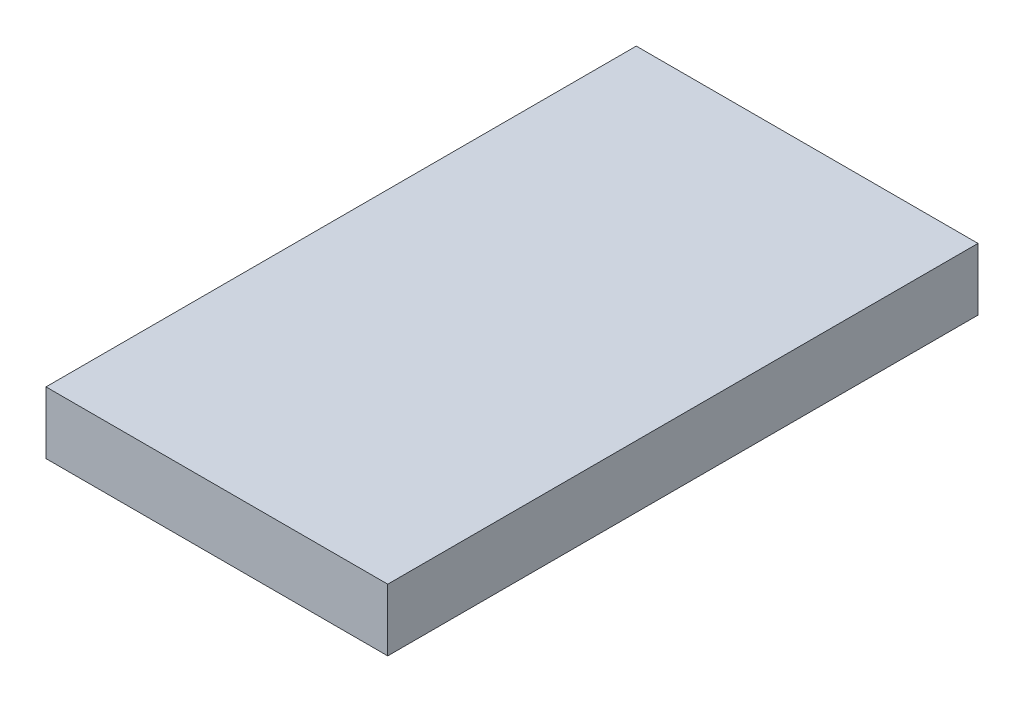
ISO-10303-21;
HEADER;
FILE_DESCRIPTION(('STEP AP214'),'2;1');
FILE_NAME('part.step','',(''),(''),'','','');
FILE_SCHEMA(('AUTOMOTIVE_DESIGN { 1 0 10303 214 1 1 1 1 }'));
ENDSEC;
DATA;
#1=APPLICATION_CONTEXT('core data for automotive mechanical design processes');
#2=APPLICATION_PROTOCOL_DEFINITION('international standard','automotive_design',2000,#1);
#3=PRODUCT_CONTEXT('',#1,'mechanical');
#4=PRODUCT('Part','Part','',(#3));
#5=PRODUCT_RELATED_PRODUCT_CATEGORY('part','',(#4));
#6=PRODUCT_DEFINITION_FORMATION('','',#4);
#7=PRODUCT_DEFINITION_CONTEXT('part definition',#1,'design');
#8=PRODUCT_DEFINITION('design','',#6,#7);
#9=PRODUCT_DEFINITION_SHAPE('','',#8);
#10=(LENGTH_UNIT() NAMED_UNIT(*) SI_UNIT(.MILLI.,.METRE.));
#11=(NAMED_UNIT(*) PLANE_ANGLE_UNIT() SI_UNIT($,.RADIAN.));
#12=(NAMED_UNIT(*) SI_UNIT($,.STERADIAN.) SOLID_ANGLE_UNIT());
#13=UNCERTAINTY_MEASURE_WITH_UNIT(LENGTH_MEASURE(1.E-05),#10,'distance_accuracy_value','');
#14=(GEOMETRIC_REPRESENTATION_CONTEXT(3) GLOBAL_UNCERTAINTY_ASSIGNED_CONTEXT((#13)) GLOBAL_UNIT_ASSIGNED_CONTEXT((#10,
#11,#12)) REPRESENTATION_CONTEXT('',''));
#15=CARTESIAN_POINT('',(0.,0.,0.));
#16=DIRECTION('',(0.,0.,1.));
#17=DIRECTION('',(1.,0.,0.));
#18=AXIS2_PLACEMENT_3D('',#15,#16,#17);
#19=CARTESIAN_POINT('',(13.75,5.,-23.75));
#20=DIRECTION('',(-1.,0.,0.));
#21=DIRECTION('',(0.,0.,1.));
#22=AXIS2_PLACEMENT_3D('',#19,#20,#21);
#23=PLANE('',#22);
#24=DIRECTION('',(0.,0.,-1.));
#25=VECTOR('',#24,1.);
#26=CARTESIAN_POINT('',(13.75,0.,-23.75));
#27=LINE('',#26,#25);
#28=CARTESIAN_POINT('',(13.75,0.,23.75));
#29=VERTEX_POINT('',#28);
#30=CARTESIAN_POINT('',(13.75,0.,-23.75));
#31=VERTEX_POINT('',#30);
#32=EDGE_CURVE('E96',#29,#31,#27,.T.);
#33=ORIENTED_EDGE('',*,*,#32,.T.);
#34=DIRECTION('',(0.,-1.,0.));
#35=VECTOR('',#34,1.);
#36=CARTESIAN_POINT('',(13.75,5.,-23.75));
#37=LINE('',#36,#35);
#38=CARTESIAN_POINT('',(13.75,5.,-23.75));
#39=VERTEX_POINT('',#38);
#40=EDGE_CURVE('E11',#39,#31,#37,.T.);
#41=ORIENTED_EDGE('',*,*,#40,.F.);
#42=DIRECTION('',(0.,0.,-1.));
#43=VECTOR('',#42,1.);
#44=CARTESIAN_POINT('',(13.75,5.,-23.75));
#45=LINE('',#44,#43);
#46=CARTESIAN_POINT('',(13.75,5.,23.75));
#47=VERTEX_POINT('',#46);
#48=EDGE_CURVE('E84',#47,#39,#45,.T.);
#49=ORIENTED_EDGE('',*,*,#48,.F.);
#50=DIRECTION('',(0.,-1.,0.));
#51=VECTOR('',#50,1.);
#52=CARTESIAN_POINT('',(13.75,5.,23.75));
#53=LINE('',#52,#51);
#54=EDGE_CURVE('E92',#47,#29,#53,.T.);
#55=ORIENTED_EDGE('',*,*,#54,.T.);
#56=EDGE_LOOP('',(#33,#41,#49,#55));
#57=FACE_BOUND('',#56,.T.);
#58=ADVANCED_FACE('F33',(#57),#23,.F.);
#59=CARTESIAN_POINT('',(-13.75,5.,-23.75));
#60=DIRECTION('',(0.,0.,1.));
#61=DIRECTION('',(1.,0.,0.));
#62=AXIS2_PLACEMENT_3D('',#59,#60,#61);
#63=PLANE('',#62);
#64=DIRECTION('',(-1.,0.,0.));
#65=VECTOR('',#64,1.);
#66=CARTESIAN_POINT('',(-13.75,0.,-23.75));
#67=LINE('',#66,#65);
#68=CARTESIAN_POINT('',(-13.75,0.,-23.75));
#69=VERTEX_POINT('',#68);
#70=EDGE_CURVE('E88',#31,#69,#67,.T.);
#71=ORIENTED_EDGE('',*,*,#70,.T.);
#72=DIRECTION('',(0.,-1.,0.));
#73=VECTOR('',#72,1.);
#74=CARTESIAN_POINT('',(-13.75,5.,-23.75));
#75=LINE('',#74,#73);
#76=CARTESIAN_POINT('',(-13.75,5.,-23.75));
#77=VERTEX_POINT('',#76);
#78=EDGE_CURVE('E41',#77,#69,#75,.T.);
#79=ORIENTED_EDGE('',*,*,#78,.F.);
#80=DIRECTION('',(-1.,0.,0.));
#81=VECTOR('',#80,1.);
#82=CARTESIAN_POINT('',(-13.75,5.,-23.75));
#83=LINE('',#82,#81);
#84=EDGE_CURVE('E79',#39,#77,#83,.T.);
#85=ORIENTED_EDGE('',*,*,#84,.F.);
#86=ORIENTED_EDGE('',*,*,#40,.T.);
#87=EDGE_LOOP('',(#71,#79,#85,#86));
#88=FACE_BOUND('',#87,.T.);
#89=ADVANCED_FACE('F87',(#88),#63,.F.);
#90=CARTESIAN_POINT('',(-13.75,5.,-23.75));
#91=DIRECTION('',(1.,0.,0.));
#92=DIRECTION('',(0.,0.,-1.));
#93=AXIS2_PLACEMENT_3D('',#90,#91,#92);
#94=PLANE('',#93);
#95=DIRECTION('',(0.,0.,1.));
#96=VECTOR('',#95,1.);
#97=CARTESIAN_POINT('',(-13.75,0.,-23.75));
#98=LINE('',#97,#96);
#99=CARTESIAN_POINT('',(-13.75,0.,23.75));
#100=VERTEX_POINT('',#99);
#101=EDGE_CURVE('E66',#69,#100,#98,.T.);
#102=ORIENTED_EDGE('',*,*,#101,.T.);
#103=DIRECTION('',(0.,-1.,0.));
#104=VECTOR('',#103,1.);
#105=CARTESIAN_POINT('',(-13.75,5.,23.75));
#106=LINE('',#105,#104);
#107=CARTESIAN_POINT('',(-13.75,5.,23.75));
#108=VERTEX_POINT('',#107);
#109=EDGE_CURVE('E89',#108,#100,#106,.T.);
#110=ORIENTED_EDGE('',*,*,#109,.F.);
#111=DIRECTION('',(0.,0.,1.));
#112=VECTOR('',#111,1.);
#113=CARTESIAN_POINT('',(-13.75,5.,-23.75));
#114=LINE('',#113,#112);
#115=EDGE_CURVE('E82',#77,#108,#114,.T.);
#116=ORIENTED_EDGE('',*,*,#115,.F.);
#117=ORIENTED_EDGE('',*,*,#78,.T.);
#118=EDGE_LOOP('',(#102,#110,#116,#117));
#119=FACE_BOUND('',#118,.T.);
#120=ADVANCED_FACE('F90',(#119),#94,.F.);
#121=CARTESIAN_POINT('',(-13.75,5.,23.75));
#122=DIRECTION('',(0.,0.,-1.));
#123=DIRECTION('',(-1.,0.,0.));
#124=AXIS2_PLACEMENT_3D('',#121,#122,#123);
#125=PLANE('',#124);
#126=DIRECTION('',(1.,0.,0.));
#127=VECTOR('',#126,1.);
#128=CARTESIAN_POINT('',(-13.75,0.,23.75));
#129=LINE('',#128,#127);
#130=EDGE_CURVE('E72',#100,#29,#129,.T.);
#131=ORIENTED_EDGE('',*,*,#130,.T.);
#132=ORIENTED_EDGE('',*,*,#54,.F.);
#133=DIRECTION('',(1.,0.,0.));
#134=VECTOR('',#133,1.);
#135=CARTESIAN_POINT('',(-13.75,5.,23.75));
#136=LINE('',#135,#134);
#137=EDGE_CURVE('E49',#108,#47,#136,.T.);
#138=ORIENTED_EDGE('',*,*,#137,.F.);
#139=ORIENTED_EDGE('',*,*,#109,.T.);
#140=EDGE_LOOP('',(#131,#132,#138,#139));
#141=FACE_BOUND('',#140,.T.);
#142=ADVANCED_FACE('F103',(#141),#125,.F.);
#143=CARTESIAN_POINT('',(0.,5.,0.));
#144=DIRECTION('',(0.,1.,0.));
#145=DIRECTION('',(0.,0.,1.));
#146=AXIS2_PLACEMENT_3D('',#143,#144,#145);
#147=PLANE('',#146);
#148=ORIENTED_EDGE('',*,*,#48,.T.);
#149=ORIENTED_EDGE('',*,*,#84,.T.);
#150=ORIENTED_EDGE('',*,*,#115,.T.);
#151=ORIENTED_EDGE('',*,*,#137,.T.);
#152=EDGE_LOOP('',(#148,#149,#150,#151));
#153=FACE_BOUND('',#152,.T.);
#154=ADVANCED_FACE('F80',(#153),#147,.T.);
#155=CARTESIAN_POINT('',(0.,0.,0.));
#156=DIRECTION('',(0.,1.,0.));
#157=DIRECTION('',(0.,0.,1.));
#158=AXIS2_PLACEMENT_3D('',#155,#156,#157);
#159=PLANE('',#158);
#160=ORIENTED_EDGE('',*,*,#32,.F.);
#161=ORIENTED_EDGE('',*,*,#130,.F.);
#162=ORIENTED_EDGE('',*,*,#101,.F.);
#163=ORIENTED_EDGE('',*,*,#70,.F.);
#164=EDGE_LOOP('',(#160,#161,#162,#163));
#165=FACE_BOUND('',#164,.T.);
#166=ADVANCED_FACE('F106',(#165),#159,.F.);
#167=CLOSED_SHELL('',(#58,#89,#120,#142,#154,#166));
#168=MANIFOLD_SOLID_BREP('B2',#167);
#169=ADVANCED_BREP_SHAPE_REPRESENTATION('',(#18,#168),#14);
#170=SHAPE_DEFINITION_REPRESENTATION(#9,#169);
ENDSEC;
END-ISO-10303-21;
